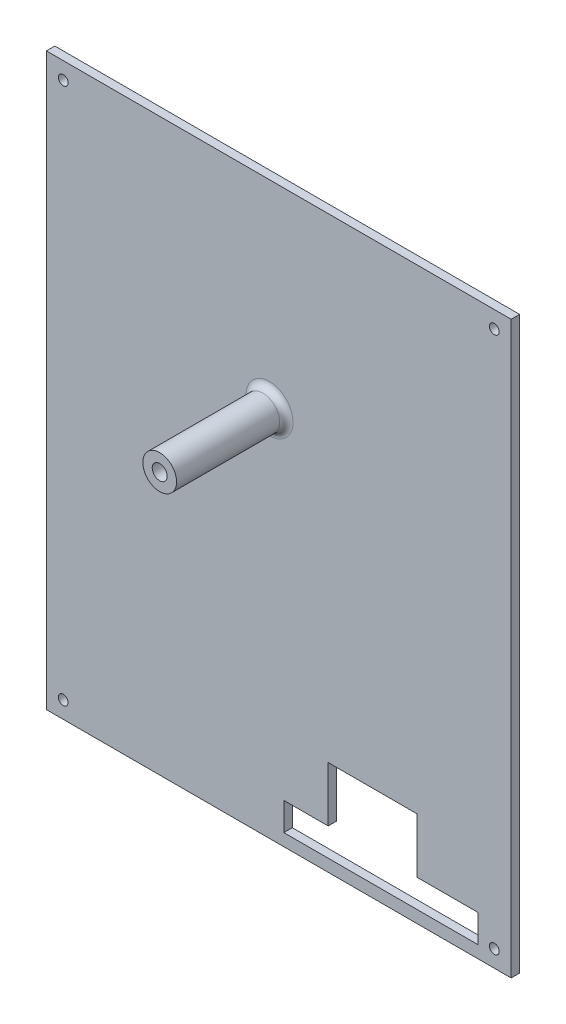
ISO-10303-21;
HEADER;
FILE_DESCRIPTION(('STEP AP214'),'2;1');
FILE_NAME('part.step','',(''),(''),'','','');
FILE_SCHEMA(('AUTOMOTIVE_DESIGN { 1 0 10303 214 1 1 1 1 }'));
ENDSEC;
DATA;
#1=APPLICATION_CONTEXT('core data for automotive mechanical design processes');
#2=APPLICATION_PROTOCOL_DEFINITION('international standard','automotive_design',2000,#1);
#3=PRODUCT_CONTEXT('',#1,'mechanical');
#4=PRODUCT('Part','Part','',(#3));
#5=PRODUCT_RELATED_PRODUCT_CATEGORY('part','',(#4));
#6=PRODUCT_DEFINITION_FORMATION('','',#4);
#7=PRODUCT_DEFINITION_CONTEXT('part definition',#1,'design');
#8=PRODUCT_DEFINITION('design','',#6,#7);
#9=PRODUCT_DEFINITION_SHAPE('','',#8);
#10=(LENGTH_UNIT() NAMED_UNIT(*) SI_UNIT(.MILLI.,.METRE.));
#11=(NAMED_UNIT(*) PLANE_ANGLE_UNIT() SI_UNIT($,.RADIAN.));
#12=(NAMED_UNIT(*) SI_UNIT($,.STERADIAN.) SOLID_ANGLE_UNIT());
#13=UNCERTAINTY_MEASURE_WITH_UNIT(LENGTH_MEASURE(1.E-05),#10,'distance_accuracy_value','');
#14=(GEOMETRIC_REPRESENTATION_CONTEXT(3) GLOBAL_UNCERTAINTY_ASSIGNED_CONTEXT((#13)) GLOBAL_UNIT_ASSIGNED_CONTEXT((#10,
#11,#12)) REPRESENTATION_CONTEXT('',''));
#15=CARTESIAN_POINT('',(0.,0.,0.));
#16=DIRECTION('',(0.,0.,1.));
#17=DIRECTION('',(1.,0.,0.));
#18=AXIS2_PLACEMENT_3D('',#15,#16,#17);
#19=CARTESIAN_POINT('',(0.,0.,2.54));
#20=DIRECTION('',(-1.,0.,0.));
#21=DIRECTION('',(0.,0.,1.));
#22=AXIS2_PLACEMENT_3D('',#19,#20,#21);
#23=PLANE('',#22);
#24=DIRECTION('',(0.,1.,0.));
#25=VECTOR('',#24,1.);
#26=CARTESIAN_POINT('',(0.,0.,0.));
#27=LINE('',#26,#25);
#28=CARTESIAN_POINT('',(0.,0.,0.));
#29=VERTEX_POINT('',#28);
#30=CARTESIAN_POINT('',(0.,171.45,0.));
#31=VERTEX_POINT('',#30);
#32=EDGE_CURVE('E187',#29,#31,#27,.T.);
#33=ORIENTED_EDGE('',*,*,#32,.T.);
#34=DIRECTION('',(0.,0.,-1.));
#35=VECTOR('',#34,1.);
#36=CARTESIAN_POINT('',(0.,171.45,2.54));
#37=LINE('',#36,#35);
#38=CARTESIAN_POINT('',(0.,171.45,2.54));
#39=VERTEX_POINT('',#38);
#40=EDGE_CURVE('E225',#39,#31,#37,.T.);
#41=ORIENTED_EDGE('',*,*,#40,.F.);
#42=DIRECTION('',(0.,1.,0.));
#43=VECTOR('',#42,1.);
#44=CARTESIAN_POINT('',(0.,0.,2.54));
#45=LINE('',#44,#43);
#46=CARTESIAN_POINT('',(0.,0.,2.54));
#47=VERTEX_POINT('',#46);
#48=EDGE_CURVE('E199',#47,#39,#45,.T.);
#49=ORIENTED_EDGE('',*,*,#48,.F.);
#50=DIRECTION('',(0.,0.,-1.));
#51=VECTOR('',#50,1.);
#52=CARTESIAN_POINT('',(0.,0.,2.54));
#53=LINE('',#52,#51);
#54=EDGE_CURVE('E209',#47,#29,#53,.T.);
#55=ORIENTED_EDGE('',*,*,#54,.T.);
#56=EDGE_LOOP('',(#33,#41,#49,#55));
#57=FACE_BOUND('',#56,.T.);
#58=ADVANCED_FACE('F37',(#57),#23,.F.);
#59=CARTESIAN_POINT('',(0.,171.45,2.54));
#60=DIRECTION('',(0.,-1.,0.));
#61=DIRECTION('',(0.,0.,-1.));
#62=AXIS2_PLACEMENT_3D('',#59,#60,#61);
#63=PLANE('',#62);
#64=DIRECTION('',(-1.,0.,0.));
#65=VECTOR('',#64,1.);
#66=CARTESIAN_POINT('',(0.,171.45,0.));
#67=LINE('',#66,#65);
#68=CARTESIAN_POINT('',(-139.7,171.45,0.));
#69=VERTEX_POINT('',#68);
#70=EDGE_CURVE('E212',#31,#69,#67,.T.);
#71=ORIENTED_EDGE('',*,*,#70,.T.);
#72=DIRECTION('',(0.,0.,-1.));
#73=VECTOR('',#72,1.);
#74=CARTESIAN_POINT('',(-139.7,171.45,2.54));
#75=LINE('',#74,#73);
#76=CARTESIAN_POINT('',(-139.7,171.45,2.54));
#77=VERTEX_POINT('',#76);
#78=EDGE_CURVE('E222',#77,#69,#75,.T.);
#79=ORIENTED_EDGE('',*,*,#78,.F.);
#80=DIRECTION('',(-1.,0.,0.));
#81=VECTOR('',#80,1.);
#82=CARTESIAN_POINT('',(0.,171.45,2.54));
#83=LINE('',#82,#81);
#84=EDGE_CURVE('E202',#39,#77,#83,.T.);
#85=ORIENTED_EDGE('',*,*,#84,.F.);
#86=ORIENTED_EDGE('',*,*,#40,.T.);
#87=EDGE_LOOP('',(#71,#79,#85,#86));
#88=FACE_BOUND('',#87,.T.);
#89=ADVANCED_FACE('F248',(#88),#63,.F.);
#90=CARTESIAN_POINT('',(-139.7,0.,2.54));
#91=DIRECTION('',(1.,0.,0.));
#92=DIRECTION('',(0.,0.,-1.));
#93=AXIS2_PLACEMENT_3D('',#90,#91,#92);
#94=PLANE('',#93);
#95=DIRECTION('',(0.,-1.,0.));
#96=VECTOR('',#95,1.);
#97=CARTESIAN_POINT('',(-139.7,0.,0.));
#98=LINE('',#97,#96);
#99=CARTESIAN_POINT('',(-139.7,0.,0.));
#100=VERTEX_POINT('',#99);
#101=EDGE_CURVE('E214',#69,#100,#98,.T.);
#102=ORIENTED_EDGE('',*,*,#101,.T.);
#103=DIRECTION('',(0.,0.,-1.));
#104=VECTOR('',#103,1.);
#105=CARTESIAN_POINT('',(-139.7,0.,2.54));
#106=LINE('',#105,#104);
#107=CARTESIAN_POINT('',(-139.7,0.,2.54));
#108=VERTEX_POINT('',#107);
#109=EDGE_CURVE('E219',#108,#100,#106,.T.);
#110=ORIENTED_EDGE('',*,*,#109,.F.);
#111=DIRECTION('',(0.,-1.,0.));
#112=VECTOR('',#111,1.);
#113=CARTESIAN_POINT('',(-139.7,0.,2.54));
#114=LINE('',#113,#112);
#115=EDGE_CURVE('E205',#77,#108,#114,.T.);
#116=ORIENTED_EDGE('',*,*,#115,.F.);
#117=ORIENTED_EDGE('',*,*,#78,.T.);
#118=EDGE_LOOP('',(#102,#110,#116,#117));
#119=FACE_BOUND('',#118,.T.);
#120=ADVANCED_FACE('F253',(#119),#94,.F.);
#121=CARTESIAN_POINT('',(0.,0.,2.54));
#122=DIRECTION('',(0.,1.,0.));
#123=DIRECTION('',(-1.,0.,0.));
#124=AXIS2_PLACEMENT_3D('',#121,#122,#123);
#125=PLANE('',#124);
#126=DIRECTION('',(1.,0.,0.));
#127=VECTOR('',#126,1.);
#128=CARTESIAN_POINT('',(0.,0.,0.));
#129=LINE('',#128,#127);
#130=EDGE_CURVE('E203',#100,#29,#129,.T.);
#131=ORIENTED_EDGE('',*,*,#130,.T.);
#132=ORIENTED_EDGE('',*,*,#54,.F.);
#133=DIRECTION('',(1.,0.,0.));
#134=VECTOR('',#133,1.);
#135=CARTESIAN_POINT('',(0.,0.,2.54));
#136=LINE('',#135,#134);
#137=EDGE_CURVE('E207',#108,#47,#136,.T.);
#138=ORIENTED_EDGE('',*,*,#137,.F.);
#139=ORIENTED_EDGE('',*,*,#109,.T.);
#140=EDGE_LOOP('',(#131,#132,#138,#139));
#141=FACE_BOUND('',#140,.T.);
#142=ADVANCED_FACE('F259',(#141),#125,.F.);
#143=CARTESIAN_POINT('',(0.,0.,2.54));
#144=DIRECTION('',(0.,0.,1.));
#145=DIRECTION('',(1.,0.,0.));
#146=AXIS2_PLACEMENT_3D('',#143,#144,#145);
#147=PLANE('',#146);
#148=CARTESIAN_POINT('',(-72.6333457174165,111.8489,2.54));
#149=DIRECTION('',(0.,0.,1.));
#150=DIRECTION('',(1.,0.,0.));
#151=AXIS2_PLACEMENT_3D('',#148,#149,#150);
#152=CIRCLE('',#151,7.075);
#153=CARTESIAN_POINT('',(-65.5583457174165,111.8489,2.54));
#154=VERTEX_POINT('',#153);
#155=EDGE_CURVE('E11',#154,#154,#152,.F.);
#156=ORIENTED_EDGE('',*,*,#155,.T.);
#157=EDGE_LOOP('',(#156));
#158=FACE_BOUND('',#157,.T.);
#159=CARTESIAN_POINT('',(-5.08,5.07999999999998,2.54));
#160=DIRECTION('',(0.,0.,1.));
#161=DIRECTION('',(-1.,0.,0.));
#162=AXIS2_PLACEMENT_3D('',#159,#160,#161);
#163=CIRCLE('',#162,1.46685);
#164=CARTESIAN_POINT('',(-6.54685,5.07999999999998,2.54));
#165=VERTEX_POINT('',#164);
#166=EDGE_CURVE('E344',#165,#165,#163,.T.);
#167=ORIENTED_EDGE('',*,*,#166,.F.);
#168=EDGE_LOOP('',(#167));
#169=FACE_BOUND('',#168,.T.);
#170=CARTESIAN_POINT('',(-5.08,166.37,2.54));
#171=DIRECTION('',(0.,0.,1.));
#172=DIRECTION('',(1.,0.,0.));
#173=AXIS2_PLACEMENT_3D('',#170,#171,#172);
#174=CIRCLE('',#173,1.46685);
#175=CARTESIAN_POINT('',(-3.61315,166.37,2.54));
#176=VERTEX_POINT('',#175);
#177=EDGE_CURVE('E338',#176,#176,#174,.T.);
#178=ORIENTED_EDGE('',*,*,#177,.F.);
#179=EDGE_LOOP('',(#178));
#180=FACE_BOUND('',#179,.T.);
#181=CARTESIAN_POINT('',(-134.62,166.37,2.54));
#182=DIRECTION('',(0.,0.,1.));
#183=DIRECTION('',(-1.,0.,0.));
#184=AXIS2_PLACEMENT_3D('',#181,#182,#183);
#185=CIRCLE('',#184,1.46684999999998);
#186=CARTESIAN_POINT('',(-136.08685,166.37,2.54));
#187=VERTEX_POINT('',#186);
#188=EDGE_CURVE('E332',#187,#187,#185,.T.);
#189=ORIENTED_EDGE('',*,*,#188,.F.);
#190=EDGE_LOOP('',(#189));
#191=FACE_BOUND('',#190,.T.);
#192=CARTESIAN_POINT('',(-134.62,5.07999999999998,2.54));
#193=DIRECTION('',(0.,0.,1.));
#194=DIRECTION('',(1.,0.,0.));
#195=AXIS2_PLACEMENT_3D('',#192,#193,#194);
#196=CIRCLE('',#195,1.46684999999999);
#197=CARTESIAN_POINT('',(-133.15315,5.07999999999998,2.54));
#198=VERTEX_POINT('',#197);
#199=EDGE_CURVE('E151',#198,#198,#196,.T.);
#200=ORIENTED_EDGE('',*,*,#199,.F.);
#201=EDGE_LOOP('',(#200));
#202=FACE_BOUND('',#201,.T.);
#203=DIRECTION('',(0.,-1.,0.));
#204=VECTOR('',#203,1.);
#205=CARTESIAN_POINT('',(-68.326,12.065,2.54));
#206=LINE('',#205,#204);
#207=CARTESIAN_POINT('',(-68.326,12.065,2.54));
#208=VERTEX_POINT('',#207);
#209=CARTESIAN_POINT('',(-68.326,3.68299999999998,2.54));
#210=VERTEX_POINT('',#209);
#211=EDGE_CURVE('E52',#208,#210,#206,.T.);
#212=ORIENTED_EDGE('',*,*,#211,.F.);
#213=DIRECTION('',(-1.,0.,0.));
#214=VECTOR('',#213,1.);
#215=CARTESIAN_POINT('',(-68.326,12.065,2.54));
#216=LINE('',#215,#214);
#217=CARTESIAN_POINT('',(-54.991,12.065,2.54));
#218=VERTEX_POINT('',#217);
#219=EDGE_CURVE('E145',#218,#208,#216,.T.);
#220=ORIENTED_EDGE('',*,*,#219,.F.);
#221=DIRECTION('',(0.,-1.,0.));
#222=VECTOR('',#221,1.);
#223=CARTESIAN_POINT('',(-54.991,28.575,2.54));
#224=LINE('',#223,#222);
#225=CARTESIAN_POINT('',(-54.991,28.575,2.54));
#226=VERTEX_POINT('',#225);
#227=EDGE_CURVE('E148',#226,#218,#224,.T.);
#228=ORIENTED_EDGE('',*,*,#227,.F.);
#229=DIRECTION('',(-1.,0.,0.));
#230=VECTOR('',#229,1.);
#231=CARTESIAN_POINT('',(-49.911,28.575,2.54));
#232=LINE('',#231,#230);
#233=CARTESIAN_POINT('',(-28.321,28.575,2.54));
#234=VERTEX_POINT('',#233);
#235=EDGE_CURVE('E180',#234,#226,#232,.T.);
#236=ORIENTED_EDGE('',*,*,#235,.F.);
#237=DIRECTION('',(0.,1.,0.));
#238=VECTOR('',#237,1.);
#239=CARTESIAN_POINT('',(-28.321,12.065,2.54));
#240=LINE('',#239,#238);
#241=CARTESIAN_POINT('',(-28.321,12.065,2.54));
#242=VERTEX_POINT('',#241);
#243=EDGE_CURVE('E177',#242,#234,#240,.T.);
#244=ORIENTED_EDGE('',*,*,#243,.F.);
#245=DIRECTION('',(-1.,0.,0.));
#246=VECTOR('',#245,1.);
#247=CARTESIAN_POINT('',(-28.321,12.065,2.54));
#248=LINE('',#247,#246);
#249=CARTESIAN_POINT('',(-9.906,12.065,2.54));
#250=VERTEX_POINT('',#249);
#251=EDGE_CURVE('E174',#250,#242,#248,.T.);
#252=ORIENTED_EDGE('',*,*,#251,.F.);
#253=DIRECTION('',(0.,1.,0.));
#254=VECTOR('',#253,1.);
#255=CARTESIAN_POINT('',(-9.906,12.065,2.54));
#256=LINE('',#255,#254);
#257=CARTESIAN_POINT('',(-9.90600000000001,3.68299999999998,2.54));
#258=VERTEX_POINT('',#257);
#259=EDGE_CURVE('E171',#258,#250,#256,.T.);
#260=ORIENTED_EDGE('',*,*,#259,.F.);
#261=DIRECTION('',(1.,0.,0.));
#262=VECTOR('',#261,1.);
#263=CARTESIAN_POINT('',(-68.326,3.68299999999998,2.54));
#264=LINE('',#263,#262);
#265=EDGE_CURVE('E168',#210,#258,#264,.T.);
#266=ORIENTED_EDGE('',*,*,#265,.F.);
#267=EDGE_LOOP('',(#212,#220,#228,#236,#244,#252,#260,#266));
#268=FACE_BOUND('',#267,.T.);
#269=ORIENTED_EDGE('',*,*,#48,.T.);
#270=ORIENTED_EDGE('',*,*,#84,.T.);
#271=ORIENTED_EDGE('',*,*,#115,.T.);
#272=ORIENTED_EDGE('',*,*,#137,.T.);
#273=EDGE_LOOP('',(#269,#270,#271,#272));
#274=FACE_BOUND('',#273,.T.);
#275=ADVANCED_FACE('F263',(#158,#169,#180,#191,#202,#268,#274),#147,.T.);
#276=CARTESIAN_POINT('',(0.,0.,0.));
#277=DIRECTION('',(0.,0.,1.));
#278=DIRECTION('',(1.,0.,0.));
#279=AXIS2_PLACEMENT_3D('',#276,#277,#278);
#280=PLANE('',#279);
#281=CARTESIAN_POINT('',(-5.08,5.07999999999998,0.));
#282=DIRECTION('',(0.,0.,1.));
#283=DIRECTION('',(-1.,0.,0.));
#284=AXIS2_PLACEMENT_3D('',#281,#282,#283);
#285=CIRCLE('',#284,1.46685);
#286=CARTESIAN_POINT('',(-6.54685,5.07999999999998,0.));
#287=VERTEX_POINT('',#286);
#288=EDGE_CURVE('E327',#287,#287,#285,.T.);
#289=ORIENTED_EDGE('',*,*,#288,.T.);
#290=EDGE_LOOP('',(#289));
#291=FACE_BOUND('',#290,.T.);
#292=CARTESIAN_POINT('',(-5.08,166.37,0.));
#293=DIRECTION('',(0.,0.,1.));
#294=DIRECTION('',(1.,0.,0.));
#295=AXIS2_PLACEMENT_3D('',#292,#293,#294);
#296=CIRCLE('',#295,1.46685);
#297=CARTESIAN_POINT('',(-3.61315,166.37,0.));
#298=VERTEX_POINT('',#297);
#299=EDGE_CURVE('E341',#298,#298,#296,.T.);
#300=ORIENTED_EDGE('',*,*,#299,.T.);
#301=EDGE_LOOP('',(#300));
#302=FACE_BOUND('',#301,.T.);
#303=CARTESIAN_POINT('',(-134.62,166.37,0.));
#304=DIRECTION('',(0.,0.,1.));
#305=DIRECTION('',(-1.,0.,0.));
#306=AXIS2_PLACEMENT_3D('',#303,#304,#305);
#307=CIRCLE('',#306,1.46684999999998);
#308=CARTESIAN_POINT('',(-136.08685,166.37,0.));
#309=VERTEX_POINT('',#308);
#310=EDGE_CURVE('E335',#309,#309,#307,.T.);
#311=ORIENTED_EDGE('',*,*,#310,.T.);
#312=EDGE_LOOP('',(#311));
#313=FACE_BOUND('',#312,.T.);
#314=CARTESIAN_POINT('',(-134.62,5.07999999999998,0.));
#315=DIRECTION('',(0.,0.,1.));
#316=DIRECTION('',(1.,0.,0.));
#317=AXIS2_PLACEMENT_3D('',#314,#315,#316);
#318=CIRCLE('',#317,1.46684999999999);
#319=CARTESIAN_POINT('',(-133.15315,5.07999999999998,0.));
#320=VERTEX_POINT('',#319);
#321=EDGE_CURVE('E169',#320,#320,#318,.T.);
#322=ORIENTED_EDGE('',*,*,#321,.T.);
#323=EDGE_LOOP('',(#322));
#324=FACE_BOUND('',#323,.T.);
#325=DIRECTION('',(-1.,0.,0.));
#326=VECTOR('',#325,1.);
#327=CARTESIAN_POINT('',(-68.326,12.065,0.));
#328=LINE('',#327,#326);
#329=CARTESIAN_POINT('',(-54.991,12.065,0.));
#330=VERTEX_POINT('',#329);
#331=CARTESIAN_POINT('',(-68.326,12.065,0.));
#332=VERTEX_POINT('',#331);
#333=EDGE_CURVE('E134',#330,#332,#328,.T.);
#334=ORIENTED_EDGE('',*,*,#333,.T.);
#335=DIRECTION('',(0.,-1.,0.));
#336=VECTOR('',#335,1.);
#337=CARTESIAN_POINT('',(-68.326,12.065,0.));
#338=LINE('',#337,#336);
#339=CARTESIAN_POINT('',(-68.326,3.68299999999998,0.));
#340=VERTEX_POINT('',#339);
#341=EDGE_CURVE('E128',#332,#340,#338,.T.);
#342=ORIENTED_EDGE('',*,*,#341,.T.);
#343=DIRECTION('',(1.,0.,0.));
#344=VECTOR('',#343,1.);
#345=CARTESIAN_POINT('',(-68.326,3.68299999999998,0.));
#346=LINE('',#345,#344);
#347=CARTESIAN_POINT('',(-9.90600000000001,3.68299999999998,0.));
#348=VERTEX_POINT('',#347);
#349=EDGE_CURVE('E137',#340,#348,#346,.T.);
#350=ORIENTED_EDGE('',*,*,#349,.T.);
#351=DIRECTION('',(0.,1.,0.));
#352=VECTOR('',#351,1.);
#353=CARTESIAN_POINT('',(-9.906,12.065,0.));
#354=LINE('',#353,#352);
#355=CARTESIAN_POINT('',(-9.906,12.065,0.));
#356=VERTEX_POINT('',#355);
#357=EDGE_CURVE('E60',#348,#356,#354,.T.);
#358=ORIENTED_EDGE('',*,*,#357,.T.);
#359=DIRECTION('',(-1.,0.,0.));
#360=VECTOR('',#359,1.);
#361=CARTESIAN_POINT('',(-28.321,12.065,0.));
#362=LINE('',#361,#360);
#363=CARTESIAN_POINT('',(-28.321,12.065,0.));
#364=VERTEX_POINT('',#363);
#365=EDGE_CURVE('E155',#356,#364,#362,.T.);
#366=ORIENTED_EDGE('',*,*,#365,.T.);
#367=DIRECTION('',(0.,1.,0.));
#368=VECTOR('',#367,1.);
#369=CARTESIAN_POINT('',(-28.321,12.065,0.));
#370=LINE('',#369,#368);
#371=CARTESIAN_POINT('',(-28.321,28.575,0.));
#372=VERTEX_POINT('',#371);
#373=EDGE_CURVE('E158',#364,#372,#370,.T.);
#374=ORIENTED_EDGE('',*,*,#373,.T.);
#375=DIRECTION('',(-1.,0.,0.));
#376=VECTOR('',#375,1.);
#377=CARTESIAN_POINT('',(-49.911,28.575,0.));
#378=LINE('',#377,#376);
#379=CARTESIAN_POINT('',(-54.991,28.575,0.));
#380=VERTEX_POINT('',#379);
#381=EDGE_CURVE('E161',#372,#380,#378,.T.);
#382=ORIENTED_EDGE('',*,*,#381,.T.);
#383=DIRECTION('',(0.,-1.,0.));
#384=VECTOR('',#383,1.);
#385=CARTESIAN_POINT('',(-54.991,28.575,0.));
#386=LINE('',#385,#384);
#387=EDGE_CURVE('E164',#380,#330,#386,.T.);
#388=ORIENTED_EDGE('',*,*,#387,.T.);
#389=EDGE_LOOP('',(#334,#342,#350,#358,#366,#374,#382,#388));
#390=FACE_BOUND('',#389,.T.);
#391=ORIENTED_EDGE('',*,*,#32,.F.);
#392=ORIENTED_EDGE('',*,*,#130,.F.);
#393=ORIENTED_EDGE('',*,*,#101,.F.);
#394=ORIENTED_EDGE('',*,*,#70,.F.);
#395=EDGE_LOOP('',(#391,#392,#393,#394));
#396=FACE_BOUND('',#395,.T.);
#397=ADVANCED_FACE('F141',(#291,#302,#313,#324,#390,#396),#280,.F.);
#398=CARTESIAN_POINT('',(-68.326,12.065,0.));
#399=DIRECTION('',(-1.,0.,0.));
#400=DIRECTION('',(0.,0.,1.));
#401=AXIS2_PLACEMENT_3D('',#398,#399,#400);
#402=PLANE('',#401);
#403=ORIENTED_EDGE('',*,*,#211,.T.);
#404=DIRECTION('',(0.,0.,1.));
#405=VECTOR('',#404,1.);
#406=CARTESIAN_POINT('',(-68.326,3.68299999999998,0.));
#407=LINE('',#406,#405);
#408=EDGE_CURVE('E124',#340,#210,#407,.T.);
#409=ORIENTED_EDGE('',*,*,#408,.F.);
#410=ORIENTED_EDGE('',*,*,#341,.F.);
#411=DIRECTION('',(0.,0.,1.));
#412=VECTOR('',#411,1.);
#413=CARTESIAN_POINT('',(-68.326,12.065,0.));
#414=LINE('',#413,#412);
#415=EDGE_CURVE('E185',#332,#208,#414,.T.);
#416=ORIENTED_EDGE('',*,*,#415,.T.);
#417=EDGE_LOOP('',(#403,#409,#410,#416));
#418=FACE_BOUND('',#417,.T.);
#419=ADVANCED_FACE('F126',(#418),#402,.F.);
#420=CARTESIAN_POINT('',(-68.326,12.065,0.));
#421=DIRECTION('',(0.,1.,0.));
#422=DIRECTION('',(-1.,0.,0.));
#423=AXIS2_PLACEMENT_3D('',#420,#421,#422);
#424=PLANE('',#423);
#425=ORIENTED_EDGE('',*,*,#219,.T.);
#426=ORIENTED_EDGE('',*,*,#415,.F.);
#427=ORIENTED_EDGE('',*,*,#333,.F.);
#428=DIRECTION('',(0.,0.,1.));
#429=VECTOR('',#428,1.);
#430=CARTESIAN_POINT('',(-54.991,12.065,0.));
#431=LINE('',#430,#429);
#432=EDGE_CURVE('E188',#330,#218,#431,.T.);
#433=ORIENTED_EDGE('',*,*,#432,.T.);
#434=EDGE_LOOP('',(#425,#426,#427,#433));
#435=FACE_BOUND('',#434,.T.);
#436=ADVANCED_FACE('F273',(#435),#424,.F.);
#437=CARTESIAN_POINT('',(-54.991,28.575,0.));
#438=DIRECTION('',(-1.,0.,0.));
#439=DIRECTION('',(0.,0.,1.));
#440=AXIS2_PLACEMENT_3D('',#437,#438,#439);
#441=PLANE('',#440);
#442=ORIENTED_EDGE('',*,*,#227,.T.);
#443=ORIENTED_EDGE('',*,*,#432,.F.);
#444=ORIENTED_EDGE('',*,*,#387,.F.);
#445=DIRECTION('',(0.,0.,1.));
#446=VECTOR('',#445,1.);
#447=CARTESIAN_POINT('',(-54.991,28.575,0.));
#448=LINE('',#447,#446);
#449=EDGE_CURVE('E190',#380,#226,#448,.T.);
#450=ORIENTED_EDGE('',*,*,#449,.T.);
#451=EDGE_LOOP('',(#442,#443,#444,#450));
#452=FACE_BOUND('',#451,.T.);
#453=ADVANCED_FACE('F291',(#452),#441,.F.);
#454=CARTESIAN_POINT('',(-49.911,28.575,0.));
#455=DIRECTION('',(0.,1.,0.));
#456=DIRECTION('',(-1.,0.,0.));
#457=AXIS2_PLACEMENT_3D('',#454,#455,#456);
#458=PLANE('',#457);
#459=ORIENTED_EDGE('',*,*,#235,.T.);
#460=ORIENTED_EDGE('',*,*,#449,.F.);
#461=ORIENTED_EDGE('',*,*,#381,.F.);
#462=DIRECTION('',(0.,0.,1.));
#463=VECTOR('',#462,1.);
#464=CARTESIAN_POINT('',(-28.321,28.575,0.));
#465=LINE('',#464,#463);
#466=EDGE_CURVE('E192',#372,#234,#465,.T.);
#467=ORIENTED_EDGE('',*,*,#466,.T.);
#468=EDGE_LOOP('',(#459,#460,#461,#467));
#469=FACE_BOUND('',#468,.T.);
#470=ADVANCED_FACE('F287',(#469),#458,.F.);
#471=CARTESIAN_POINT('',(-28.321,12.065,0.));
#472=DIRECTION('',(1.,0.,0.));
#473=DIRECTION('',(0.,1.,0.));
#474=AXIS2_PLACEMENT_3D('',#471,#472,#473);
#475=PLANE('',#474);
#476=ORIENTED_EDGE('',*,*,#243,.T.);
#477=ORIENTED_EDGE('',*,*,#466,.F.);
#478=ORIENTED_EDGE('',*,*,#373,.F.);
#479=DIRECTION('',(0.,0.,1.));
#480=VECTOR('',#479,1.);
#481=CARTESIAN_POINT('',(-28.321,12.065,0.));
#482=LINE('',#481,#480);
#483=EDGE_CURVE('E194',#364,#242,#482,.T.);
#484=ORIENTED_EDGE('',*,*,#483,.T.);
#485=EDGE_LOOP('',(#476,#477,#478,#484));
#486=FACE_BOUND('',#485,.T.);
#487=ADVANCED_FACE('F283',(#486),#475,.F.);
#488=CARTESIAN_POINT('',(-28.321,12.065,0.));
#489=DIRECTION('',(0.,1.,0.));
#490=DIRECTION('',(-1.,0.,0.));
#491=AXIS2_PLACEMENT_3D('',#488,#489,#490);
#492=PLANE('',#491);
#493=ORIENTED_EDGE('',*,*,#251,.T.);
#494=ORIENTED_EDGE('',*,*,#483,.F.);
#495=ORIENTED_EDGE('',*,*,#365,.F.);
#496=DIRECTION('',(0.,0.,1.));
#497=VECTOR('',#496,1.);
#498=CARTESIAN_POINT('',(-9.906,12.065,0.));
#499=LINE('',#498,#497);
#500=EDGE_CURVE('E196',#356,#250,#499,.T.);
#501=ORIENTED_EDGE('',*,*,#500,.T.);
#502=EDGE_LOOP('',(#493,#494,#495,#501));
#503=FACE_BOUND('',#502,.T.);
#504=ADVANCED_FACE('F280',(#503),#492,.F.);
#505=CARTESIAN_POINT('',(-9.906,12.065,0.));
#506=DIRECTION('',(1.,0.,0.));
#507=DIRECTION('',(0.,1.,0.));
#508=AXIS2_PLACEMENT_3D('',#505,#506,#507);
#509=PLANE('',#508);
#510=ORIENTED_EDGE('',*,*,#259,.T.);
#511=ORIENTED_EDGE('',*,*,#500,.F.);
#512=ORIENTED_EDGE('',*,*,#357,.F.);
#513=DIRECTION('',(0.,0.,1.));
#514=VECTOR('',#513,1.);
#515=CARTESIAN_POINT('',(-9.90600000000001,3.68299999999998,0.));
#516=LINE('',#515,#514);
#517=EDGE_CURVE('E133',#348,#258,#516,.T.);
#518=ORIENTED_EDGE('',*,*,#517,.T.);
#519=EDGE_LOOP('',(#510,#511,#512,#518));
#520=FACE_BOUND('',#519,.T.);
#521=ADVANCED_FACE('F277',(#520),#509,.F.);
#522=CARTESIAN_POINT('',(-68.326,3.68299999999998,0.));
#523=DIRECTION('',(0.,-1.,0.));
#524=DIRECTION('',(1.,0.,0.));
#525=AXIS2_PLACEMENT_3D('',#522,#523,#524);
#526=PLANE('',#525);
#527=ORIENTED_EDGE('',*,*,#265,.T.);
#528=ORIENTED_EDGE('',*,*,#517,.F.);
#529=ORIENTED_EDGE('',*,*,#349,.F.);
#530=ORIENTED_EDGE('',*,*,#408,.T.);
#531=EDGE_LOOP('',(#527,#528,#529,#530));
#532=FACE_BOUND('',#531,.T.);
#533=ADVANCED_FACE('F138',(#532),#526,.F.);
#534=CARTESIAN_POINT('',(-134.62,5.07999999999998,0.));
#535=DIRECTION('',(0.,0.,1.));
#536=DIRECTION('',(1.,0.,0.));
#537=AXIS2_PLACEMENT_3D('',#534,#535,#536);
#538=CYLINDRICAL_SURFACE('',#537,1.46684999999999);
#539=ORIENTED_EDGE('',*,*,#321,.F.);
#540=EDGE_LOOP('',(#539));
#541=FACE_BOUND('',#540,.T.);
#542=ORIENTED_EDGE('',*,*,#199,.T.);
#543=EDGE_LOOP('',(#542));
#544=FACE_BOUND('',#543,.T.);
#545=ADVANCED_FACE('F276',(#541,#544),#538,.F.);
#546=CARTESIAN_POINT('',(-134.62,166.37,0.));
#547=DIRECTION('',(0.,0.,1.));
#548=DIRECTION('',(1.,0.,0.));
#549=AXIS2_PLACEMENT_3D('',#546,#547,#548);
#550=CYLINDRICAL_SURFACE('',#549,1.46684999999998);
#551=ORIENTED_EDGE('',*,*,#310,.F.);
#552=EDGE_LOOP('',(#551));
#553=FACE_BOUND('',#552,.T.);
#554=ORIENTED_EDGE('',*,*,#188,.T.);
#555=EDGE_LOOP('',(#554));
#556=FACE_BOUND('',#555,.T.);
#557=ADVANCED_FACE('F301',(#553,#556),#550,.F.);
#558=CARTESIAN_POINT('',(-5.08,166.37,0.));
#559=DIRECTION('',(0.,0.,1.));
#560=DIRECTION('',(1.,0.,0.));
#561=AXIS2_PLACEMENT_3D('',#558,#559,#560);
#562=CYLINDRICAL_SURFACE('',#561,1.46685);
#563=ORIENTED_EDGE('',*,*,#299,.F.);
#564=EDGE_LOOP('',(#563));
#565=FACE_BOUND('',#564,.T.);
#566=ORIENTED_EDGE('',*,*,#177,.T.);
#567=EDGE_LOOP('',(#566));
#568=FACE_BOUND('',#567,.T.);
#569=ADVANCED_FACE('F306',(#565,#568),#562,.F.);
#570=CARTESIAN_POINT('',(-5.08,5.07999999999998,0.));
#571=DIRECTION('',(0.,0.,1.));
#572=DIRECTION('',(1.,0.,0.));
#573=AXIS2_PLACEMENT_3D('',#570,#571,#572);
#574=CYLINDRICAL_SURFACE('',#573,1.46685);
#575=ORIENTED_EDGE('',*,*,#288,.F.);
#576=EDGE_LOOP('',(#575));
#577=FACE_BOUND('',#576,.T.);
#578=ORIENTED_EDGE('',*,*,#166,.T.);
#579=EDGE_LOOP('',(#578));
#580=FACE_BOUND('',#579,.T.);
#581=ADVANCED_FACE('F303',(#577,#580),#574,.F.);
#582=CARTESIAN_POINT('',(-72.6333457174165,111.8489,35.54));
#583=DIRECTION('',(0.,0.,-1.));
#584=DIRECTION('',(-1.,0.,0.));
#585=AXIS2_PLACEMENT_3D('',#582,#583,#584);
#586=CYLINDRICAL_SURFACE('',#585,5.075);
#587=CARTESIAN_POINT('',(-72.6333457174165,111.8489,4.54));
#588=DIRECTION('',(0.,0.,1.));
#589=DIRECTION('',(1.,0.,0.));
#590=AXIS2_PLACEMENT_3D('',#587,#588,#589);
#591=CIRCLE('',#590,5.075);
#592=CARTESIAN_POINT('',(-67.5583457174165,111.8489,4.54));
#593=VERTEX_POINT('',#592);
#594=EDGE_CURVE('E45',#593,#593,#591,.T.);
#595=ORIENTED_EDGE('',*,*,#594,.T.);
#596=EDGE_LOOP('',(#595));
#597=FACE_BOUND('',#596,.T.);
#598=CARTESIAN_POINT('',(-72.6333457174165,111.8489,35.54));
#599=DIRECTION('',(0.,0.,1.));
#600=DIRECTION('',(1.,0.,0.));
#601=AXIS2_PLACEMENT_3D('',#598,#599,#600);
#602=CIRCLE('',#601,5.075);
#603=CARTESIAN_POINT('',(-67.5583457174165,111.8489,35.54));
#604=VERTEX_POINT('',#603);
#605=EDGE_CURVE('E323',#604,#604,#602,.T.);
#606=ORIENTED_EDGE('',*,*,#605,.F.);
#607=EDGE_LOOP('',(#606));
#608=FACE_BOUND('',#607,.T.);
#609=ADVANCED_FACE('F230',(#597,#608),#586,.T.);
#610=CARTESIAN_POINT('',(-72.6333457174165,111.8489,35.54));
#611=DIRECTION('',(0.,0.,1.));
#612=DIRECTION('',(1.,0.,0.));
#613=AXIS2_PLACEMENT_3D('',#610,#611,#612);
#614=PLANE('',#613);
#615=CARTESIAN_POINT('',(-72.6333457174165,111.8489,35.54));
#616=DIRECTION('',(0.,0.,1.));
#617=DIRECTION('',(1.,0.,0.));
#618=AXIS2_PLACEMENT_3D('',#615,#616,#617);
#619=CIRCLE('',#618,2.25);
#620=CARTESIAN_POINT('',(-70.3833457174165,111.8489,35.54));
#621=VERTEX_POINT('',#620);
#622=EDGE_CURVE('E324',#621,#621,#619,.T.);
#623=ORIENTED_EDGE('',*,*,#622,.F.);
#624=EDGE_LOOP('',(#623));
#625=FACE_BOUND('',#624,.T.);
#626=ORIENTED_EDGE('',*,*,#605,.T.);
#627=EDGE_LOOP('',(#626));
#628=FACE_BOUND('',#627,.T.);
#629=ADVANCED_FACE('F235',(#625,#628),#614,.T.);
#630=CARTESIAN_POINT('',(-72.6333457174165,111.8489,4.54));
#631=DIRECTION('',(0.,0.,1.));
#632=DIRECTION('',(1.,0.,0.));
#633=AXIS2_PLACEMENT_3D('',#630,#631,#632);
#634=TOROIDAL_SURFACE('',#633,7.075,2.);
#635=ORIENTED_EDGE('',*,*,#155,.F.);
#636=EDGE_LOOP('',(#635));
#637=FACE_BOUND('',#636,.T.);
#638=ORIENTED_EDGE('',*,*,#594,.F.);
#639=EDGE_LOOP('',(#638));
#640=FACE_BOUND('',#639,.T.);
#641=ADVANCED_FACE('F39',(#637,#640),#634,.F.);
#642=CARTESIAN_POINT('',(-72.6333457174165,111.8489,30.54));
#643=DIRECTION('',(0.,0.,1.));
#644=DIRECTION('',(1.,0.,0.));
#645=AXIS2_PLACEMENT_3D('',#642,#643,#644);
#646=CYLINDRICAL_SURFACE('',#645,2.25);
#647=CARTESIAN_POINT('',(-72.6333457174165,111.8489,30.54));
#648=DIRECTION('',(0.,0.,1.));
#649=DIRECTION('',(1.,0.,0.));
#650=AXIS2_PLACEMENT_3D('',#647,#648,#649);
#651=CIRCLE('',#650,2.25);
#652=CARTESIAN_POINT('',(-70.3833457174165,111.8489,30.54));
#653=VERTEX_POINT('',#652);
#654=EDGE_CURVE('E322',#653,#653,#651,.T.);
#655=ORIENTED_EDGE('',*,*,#654,.F.);
#656=EDGE_LOOP('',(#655));
#657=FACE_BOUND('',#656,.T.);
#658=ORIENTED_EDGE('',*,*,#622,.T.);
#659=EDGE_LOOP('',(#658));
#660=FACE_BOUND('',#659,.T.);
#661=ADVANCED_FACE('F234',(#657,#660),#646,.F.);
#662=CARTESIAN_POINT('',(-72.6333457174165,111.8489,30.54));
#663=DIRECTION('',(0.,0.,1.));
#664=DIRECTION('',(1.,0.,0.));
#665=AXIS2_PLACEMENT_3D('',#662,#663,#664);
#666=PLANE('',#665);
#667=ORIENTED_EDGE('',*,*,#654,.T.);
#668=EDGE_LOOP('',(#667));
#669=FACE_BOUND('',#668,.T.);
#670=ADVANCED_FACE('F241',(#669),#666,.T.);
#671=CLOSED_SHELL('',(#58,#89,#120,#142,#275,#397,#419,#436,#453,#470,#487,#504,#521,#533,#545,
#557,#569,#581,#609,#629,#641,#661,#670));
#672=MANIFOLD_SOLID_BREP('B2',#671);
#673=ADVANCED_BREP_SHAPE_REPRESENTATION('',(#18,#672),#14);
#674=SHAPE_DEFINITION_REPRESENTATION(#9,#673);
ENDSEC;
END-ISO-10303-21;
